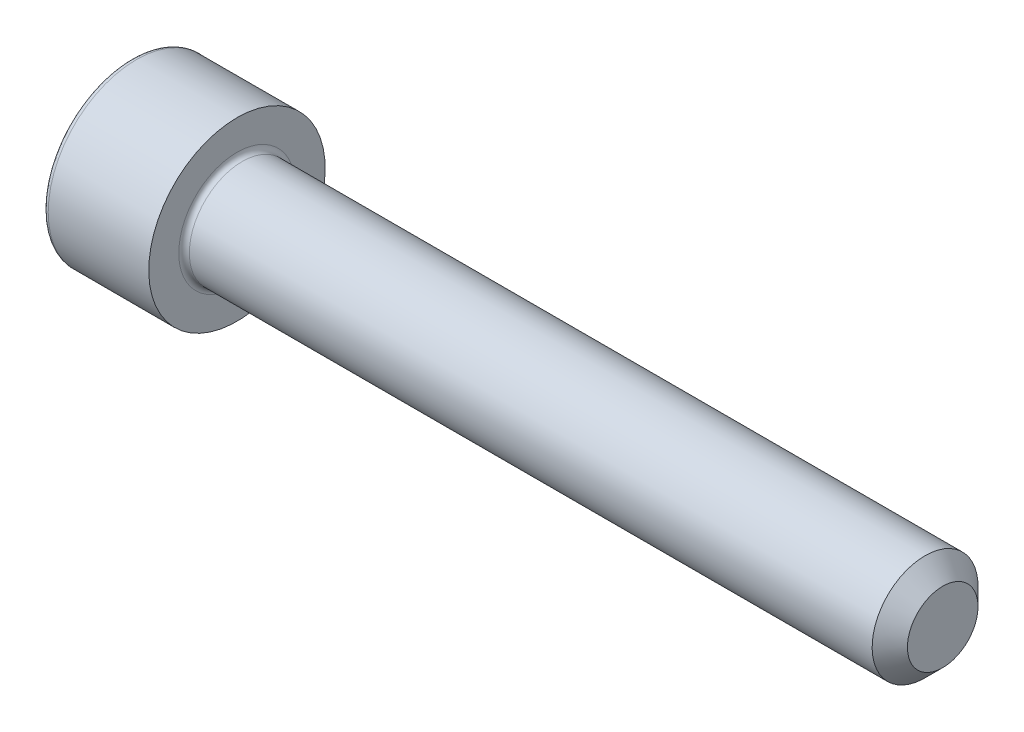
ISO-10303-21;
HEADER;
FILE_DESCRIPTION(('STEP AP214'),'2;1');
FILE_NAME('part.step','',(''),(''),'','','');
FILE_SCHEMA(('AUTOMOTIVE_DESIGN { 1 0 10303 214 1 1 1 1 }'));
ENDSEC;
DATA;
#1=APPLICATION_CONTEXT('core data for automotive mechanical design processes');
#2=APPLICATION_PROTOCOL_DEFINITION('international standard','automotive_design',2000,#1);
#3=PRODUCT_CONTEXT('',#1,'mechanical');
#4=PRODUCT('Part','Part','',(#3));
#5=PRODUCT_RELATED_PRODUCT_CATEGORY('part','',(#4));
#6=PRODUCT_DEFINITION_FORMATION('','',#4);
#7=PRODUCT_DEFINITION_CONTEXT('part definition',#1,'design');
#8=PRODUCT_DEFINITION('design','',#6,#7);
#9=PRODUCT_DEFINITION_SHAPE('','',#8);
#10=(LENGTH_UNIT() NAMED_UNIT(*) SI_UNIT(.MILLI.,.METRE.));
#11=(NAMED_UNIT(*) PLANE_ANGLE_UNIT() SI_UNIT($,.RADIAN.));
#12=(NAMED_UNIT(*) SI_UNIT($,.STERADIAN.) SOLID_ANGLE_UNIT());
#13=UNCERTAINTY_MEASURE_WITH_UNIT(LENGTH_MEASURE(1.E-05),#10,'distance_accuracy_value','');
#14=(GEOMETRIC_REPRESENTATION_CONTEXT(3) GLOBAL_UNCERTAINTY_ASSIGNED_CONTEXT((#13)) GLOBAL_UNIT_ASSIGNED_CONTEXT((#10,
#11,#12)) REPRESENTATION_CONTEXT('',''));
#15=CARTESIAN_POINT('',(0.,0.,0.));
#16=DIRECTION('',(0.,0.,1.));
#17=DIRECTION('',(1.,0.,0.));
#18=AXIS2_PLACEMENT_3D('',#15,#16,#17);
#19=CARTESIAN_POINT('',(0.,0.,0.));
#20=DIRECTION('',(-1.,0.,0.));
#21=DIRECTION('',(0.,-1.,0.));
#22=AXIS2_PLACEMENT_3D('',#19,#20,#21);
#23=PLANE('',#22);
#24=CARTESIAN_POINT('',(0.,0.,0.));
#25=DIRECTION('',(-1.,0.,0.));
#26=DIRECTION('',(0.,-1.,0.));
#27=AXIS2_PLACEMENT_3D('',#24,#25,#26);
#28=CIRCLE('',#27,4.7);
#29=CARTESIAN_POINT('',(0.,-4.7,0.));
#30=VERTEX_POINT('',#29);
#31=EDGE_CURVE('E159',#30,#30,#28,.T.);
#32=ORIENTED_EDGE('',*,*,#31,.T.);
#33=EDGE_LOOP('',(#32));
#34=FACE_BOUND('',#33,.T.);
#35=DIRECTION('',(0.,0.,-1.));
#36=VECTOR('',#35,1.);
#37=CARTESIAN_POINT('',(0.,2.5,1.44337567297407));
#38=LINE('',#37,#36);
#39=CARTESIAN_POINT('',(0.,2.5,1.44337567297407));
#40=VERTEX_POINT('',#39);
#41=CARTESIAN_POINT('',(0.,2.5,-1.44337567297406));
#42=VERTEX_POINT('',#41);
#43=EDGE_CURVE('E55',#40,#42,#38,.T.);
#44=ORIENTED_EDGE('',*,*,#43,.F.);
#45=DIRECTION('',(0.,0.866025403784439,-0.5));
#46=VECTOR('',#45,1.);
#47=CARTESIAN_POINT('',(0.,0.,2.88675134594813));
#48=LINE('',#47,#46);
#49=CARTESIAN_POINT('',(0.,0.,2.88675134594813));
#50=VERTEX_POINT('',#49);
#51=EDGE_CURVE('E138',#50,#40,#48,.T.);
#52=ORIENTED_EDGE('',*,*,#51,.F.);
#53=DIRECTION('',(0.,0.866025403784439,0.5));
#54=VECTOR('',#53,1.);
#55=CARTESIAN_POINT('',(0.,-2.5,1.44337567297406));
#56=LINE('',#55,#54);
#57=CARTESIAN_POINT('',(0.,-2.5,1.44337567297406));
#58=VERTEX_POINT('',#57);
#59=EDGE_CURVE('E136',#58,#50,#56,.T.);
#60=ORIENTED_EDGE('',*,*,#59,.F.);
#61=DIRECTION('',(0.,0.,1.));
#62=VECTOR('',#61,1.);
#63=CARTESIAN_POINT('',(0.,-2.5,-1.44337567297407));
#64=LINE('',#63,#62);
#65=CARTESIAN_POINT('',(0.,-2.5,-1.44337567297407));
#66=VERTEX_POINT('',#65);
#67=EDGE_CURVE('E103',#66,#58,#64,.T.);
#68=ORIENTED_EDGE('',*,*,#67,.F.);
#69=DIRECTION('',(0.,-0.866025403784439,0.5));
#70=VECTOR('',#69,1.);
#71=CARTESIAN_POINT('',(0.,0.,-2.88675134594813));
#72=LINE('',#71,#70);
#73=CARTESIAN_POINT('',(0.,0.,-2.88675134594813));
#74=VERTEX_POINT('',#73);
#75=EDGE_CURVE('E132',#74,#66,#72,.T.);
#76=ORIENTED_EDGE('',*,*,#75,.F.);
#77=DIRECTION('',(0.,-0.866025403784439,-0.5));
#78=VECTOR('',#77,1.);
#79=CARTESIAN_POINT('',(0.,2.5,-1.44337567297406));
#80=LINE('',#79,#78);
#81=EDGE_CURVE('E129',#42,#74,#80,.T.);
#82=ORIENTED_EDGE('',*,*,#81,.F.);
#83=EDGE_LOOP('',(#44,#52,#60,#68,#76,#82));
#84=FACE_BOUND('',#83,.T.);
#85=ADVANCED_FACE('F39',(#34,#84),#23,.T.);
#86=CARTESIAN_POINT('',(46.,0.,0.));
#87=DIRECTION('',(1.,0.,0.));
#88=DIRECTION('',(0.,1.,0.));
#89=AXIS2_PLACEMENT_3D('',#86,#87,#88);
#90=CYLINDRICAL_SURFACE('',#89,5.);
#91=CARTESIAN_POINT('',(0.300000000000002,0.,0.));
#92=DIRECTION('',(-1.,0.,0.));
#93=DIRECTION('',(0.,-1.,0.));
#94=AXIS2_PLACEMENT_3D('',#91,#92,#93);
#95=CIRCLE('',#94,5.);
#96=CARTESIAN_POINT('',(0.300000000000002,-5.,0.));
#97=VERTEX_POINT('',#96);
#98=EDGE_CURVE('E156',#97,#97,#95,.F.);
#99=ORIENTED_EDGE('',*,*,#98,.T.);
#100=EDGE_LOOP('',(#99));
#101=FACE_BOUND('',#100,.T.);
#102=CARTESIAN_POINT('',(6.,0.,0.));
#103=DIRECTION('',(1.,0.,0.));
#104=DIRECTION('',(0.,1.,0.));
#105=AXIS2_PLACEMENT_3D('',#102,#103,#104);
#106=CIRCLE('',#105,5.);
#107=CARTESIAN_POINT('',(6.,5.,0.));
#108=VERTEX_POINT('',#107);
#109=EDGE_CURVE('E142',#108,#108,#106,.T.);
#110=ORIENTED_EDGE('',*,*,#109,.F.);
#111=EDGE_LOOP('',(#110));
#112=FACE_BOUND('',#111,.T.);
#113=ADVANCED_FACE('F176',(#101,#112),#90,.T.);
#114=CARTESIAN_POINT('',(6.,5.,0.));
#115=DIRECTION('',(1.,0.,0.));
#116=DIRECTION('',(0.,1.,0.));
#117=AXIS2_PLACEMENT_3D('',#114,#115,#116);
#118=PLANE('',#117);
#119=CARTESIAN_POINT('',(6.,0.,0.));
#120=DIRECTION('',(1.,0.,0.));
#121=DIRECTION('',(0.,1.,0.));
#122=AXIS2_PLACEMENT_3D('',#119,#120,#121);
#123=CIRCLE('',#122,3.29999999999999);
#124=CARTESIAN_POINT('',(6.,3.29999999999999,0.));
#125=VERTEX_POINT('',#124);
#126=EDGE_CURVE('E153',#125,#125,#123,.F.);
#127=ORIENTED_EDGE('',*,*,#126,.T.);
#128=EDGE_LOOP('',(#127));
#129=FACE_BOUND('',#128,.T.);
#130=ORIENTED_EDGE('',*,*,#109,.T.);
#131=EDGE_LOOP('',(#130));
#132=FACE_BOUND('',#131,.T.);
#133=ADVANCED_FACE('F182',(#129,#132),#118,.T.);
#134=CARTESIAN_POINT('',(46.,0.,0.));
#135=DIRECTION('',(1.,0.,0.));
#136=DIRECTION('',(0.,1.,0.));
#137=AXIS2_PLACEMENT_3D('',#134,#135,#136);
#138=CYLINDRICAL_SURFACE('',#137,2.99999999999999);
#139=CARTESIAN_POINT('',(45.,0.,0.));
#140=DIRECTION('',(1.,0.,0.));
#141=DIRECTION('',(0.,1.,0.));
#142=AXIS2_PLACEMENT_3D('',#139,#140,#141);
#143=CIRCLE('',#142,2.99999999999999);
#144=CARTESIAN_POINT('',(45.,3.,0.));
#145=VERTEX_POINT('',#144);
#146=EDGE_CURVE('E11',#145,#145,#143,.F.);
#147=ORIENTED_EDGE('',*,*,#146,.T.);
#148=EDGE_LOOP('',(#147));
#149=FACE_BOUND('',#148,.T.);
#150=CARTESIAN_POINT('',(6.3,0.,0.));
#151=DIRECTION('',(1.,0.,0.));
#152=DIRECTION('',(0.,1.,0.));
#153=AXIS2_PLACEMENT_3D('',#150,#151,#152);
#154=CIRCLE('',#153,2.99999999999999);
#155=CARTESIAN_POINT('',(6.3,2.99999999999999,0.));
#156=VERTEX_POINT('',#155);
#157=EDGE_CURVE('E150',#156,#156,#154,.T.);
#158=ORIENTED_EDGE('',*,*,#157,.T.);
#159=EDGE_LOOP('',(#158));
#160=FACE_BOUND('',#159,.T.);
#161=ADVANCED_FACE('F199',(#149,#160),#138,.T.);
#162=CARTESIAN_POINT('',(46.,3.,0.));
#163=DIRECTION('',(1.,0.,0.));
#164=DIRECTION('',(0.,1.,0.));
#165=AXIS2_PLACEMENT_3D('',#162,#163,#164);
#166=PLANE('',#165);
#167=CARTESIAN_POINT('',(46.,0.,0.));
#168=DIRECTION('',(1.,0.,0.));
#169=DIRECTION('',(0.,1.,0.));
#170=AXIS2_PLACEMENT_3D('',#167,#168,#169);
#171=CIRCLE('',#170,1.99999999999999);
#172=CARTESIAN_POINT('',(46.,1.99999999999999,0.));
#173=VERTEX_POINT('',#172);
#174=EDGE_CURVE('E48',#173,#173,#171,.T.);
#175=ORIENTED_EDGE('',*,*,#174,.T.);
#176=EDGE_LOOP('',(#175));
#177=FACE_BOUND('',#176,.T.);
#178=ADVANCED_FACE('F164',(#177),#166,.T.);
#179=CARTESIAN_POINT('',(2.5,2.5,1.44337567297407));
#180=DIRECTION('',(0.,1.,0.));
#181=DIRECTION('',(-1.,0.,0.));
#182=AXIS2_PLACEMENT_3D('',#179,#180,#181);
#183=PLANE('',#182);
#184=ORIENTED_EDGE('',*,*,#43,.T.);
#185=DIRECTION('',(-1.,0.,0.));
#186=VECTOR('',#185,1.);
#187=CARTESIAN_POINT('',(2.5,2.5,-1.44337567297406));
#188=LINE('',#187,#186);
#189=CARTESIAN_POINT('',(2.5,2.5,-1.44337567297406));
#190=VERTEX_POINT('',#189);
#191=EDGE_CURVE('E85',#190,#42,#188,.T.);
#192=ORIENTED_EDGE('',*,*,#191,.F.);
#193=DIRECTION('',(0.,0.,-1.));
#194=VECTOR('',#193,1.);
#195=CARTESIAN_POINT('',(2.5,2.5,1.44337567297407));
#196=LINE('',#195,#194);
#197=CARTESIAN_POINT('',(2.5,2.5,1.44337567297407));
#198=VERTEX_POINT('',#197);
#199=EDGE_CURVE('E140',#198,#190,#196,.T.);
#200=ORIENTED_EDGE('',*,*,#199,.F.);
#201=DIRECTION('',(-1.,0.,0.));
#202=VECTOR('',#201,1.);
#203=CARTESIAN_POINT('',(2.5,2.5,1.44337567297407));
#204=LINE('',#203,#202);
#205=EDGE_CURVE('E63',#198,#40,#204,.T.);
#206=ORIENTED_EDGE('',*,*,#205,.T.);
#207=EDGE_LOOP('',(#184,#192,#200,#206));
#208=FACE_BOUND('',#207,.T.);
#209=ADVANCED_FACE('F207',(#208),#183,.F.);
#210=CARTESIAN_POINT('',(2.5,0.,2.88675134594813));
#211=DIRECTION('',(0.,0.5,0.866025403784439));
#212=DIRECTION('',(0.,-0.866025403784439,0.5));
#213=AXIS2_PLACEMENT_3D('',#210,#211,#212);
#214=PLANE('',#213);
#215=ORIENTED_EDGE('',*,*,#51,.T.);
#216=ORIENTED_EDGE('',*,*,#205,.F.);
#217=DIRECTION('',(0.,0.866025403784439,-0.5));
#218=VECTOR('',#217,1.);
#219=CARTESIAN_POINT('',(2.5,0.,2.88675134594813));
#220=LINE('',#219,#218);
#221=CARTESIAN_POINT('',(2.5,0.,2.88675134594813));
#222=VERTEX_POINT('',#221);
#223=EDGE_CURVE('E115',#222,#198,#220,.T.);
#224=ORIENTED_EDGE('',*,*,#223,.F.);
#225=DIRECTION('',(-1.,0.,0.));
#226=VECTOR('',#225,1.);
#227=CARTESIAN_POINT('',(2.5,0.,2.88675134594813));
#228=LINE('',#227,#226);
#229=EDGE_CURVE('E107',#222,#50,#228,.T.);
#230=ORIENTED_EDGE('',*,*,#229,.T.);
#231=EDGE_LOOP('',(#215,#216,#224,#230));
#232=FACE_BOUND('',#231,.T.);
#233=ADVANCED_FACE('F213',(#232),#214,.F.);
#234=CARTESIAN_POINT('',(2.5,-2.5,1.44337567297406));
#235=DIRECTION('',(0.,-0.5,0.866025403784439));
#236=DIRECTION('',(0.,-0.866025403784439,-0.5));
#237=AXIS2_PLACEMENT_3D('',#234,#235,#236);
#238=PLANE('',#237);
#239=ORIENTED_EDGE('',*,*,#59,.T.);
#240=ORIENTED_EDGE('',*,*,#229,.F.);
#241=DIRECTION('',(0.,0.866025403784439,0.5));
#242=VECTOR('',#241,1.);
#243=CARTESIAN_POINT('',(2.5,-2.5,1.44337567297406));
#244=LINE('',#243,#242);
#245=CARTESIAN_POINT('',(2.5,-2.5,1.44337567297406));
#246=VERTEX_POINT('',#245);
#247=EDGE_CURVE('E111',#246,#222,#244,.T.);
#248=ORIENTED_EDGE('',*,*,#247,.F.);
#249=DIRECTION('',(-1.,0.,0.));
#250=VECTOR('',#249,1.);
#251=CARTESIAN_POINT('',(2.5,-2.5,1.44337567297406));
#252=LINE('',#251,#250);
#253=EDGE_CURVE('E96',#246,#58,#252,.T.);
#254=ORIENTED_EDGE('',*,*,#253,.T.);
#255=EDGE_LOOP('',(#239,#240,#248,#254));
#256=FACE_BOUND('',#255,.T.);
#257=ADVANCED_FACE('F112',(#256),#238,.F.);
#258=CARTESIAN_POINT('',(2.5,-2.5,-1.44337567297407));
#259=DIRECTION('',(0.,-1.,0.));
#260=DIRECTION('',(1.,0.,0.));
#261=AXIS2_PLACEMENT_3D('',#258,#259,#260);
#262=PLANE('',#261);
#263=ORIENTED_EDGE('',*,*,#67,.T.);
#264=ORIENTED_EDGE('',*,*,#253,.F.);
#265=DIRECTION('',(0.,0.,1.));
#266=VECTOR('',#265,1.);
#267=CARTESIAN_POINT('',(2.5,-2.5,-1.44337567297407));
#268=LINE('',#267,#266);
#269=CARTESIAN_POINT('',(2.5,-2.5,-1.44337567297407));
#270=VERTEX_POINT('',#269);
#271=EDGE_CURVE('E100',#270,#246,#268,.T.);
#272=ORIENTED_EDGE('',*,*,#271,.F.);
#273=DIRECTION('',(-1.,0.,0.));
#274=VECTOR('',#273,1.);
#275=CARTESIAN_POINT('',(2.5,-2.5,-1.44337567297407));
#276=LINE('',#275,#274);
#277=EDGE_CURVE('E108',#270,#66,#276,.T.);
#278=ORIENTED_EDGE('',*,*,#277,.T.);
#279=EDGE_LOOP('',(#263,#264,#272,#278));
#280=FACE_BOUND('',#279,.T.);
#281=ADVANCED_FACE('F98',(#280),#262,.F.);
#282=CARTESIAN_POINT('',(2.5,0.,-2.88675134594813));
#283=DIRECTION('',(0.,-0.5,-0.866025403784439));
#284=DIRECTION('',(0.,0.866025403784439,-0.5));
#285=AXIS2_PLACEMENT_3D('',#282,#283,#284);
#286=PLANE('',#285);
#287=ORIENTED_EDGE('',*,*,#75,.T.);
#288=ORIENTED_EDGE('',*,*,#277,.F.);
#289=DIRECTION('',(0.,-0.866025403784439,0.5));
#290=VECTOR('',#289,1.);
#291=CARTESIAN_POINT('',(2.5,0.,-2.88675134594813));
#292=LINE('',#291,#290);
#293=CARTESIAN_POINT('',(2.5,0.,-2.88675134594813));
#294=VERTEX_POINT('',#293);
#295=EDGE_CURVE('E121',#294,#270,#292,.T.);
#296=ORIENTED_EDGE('',*,*,#295,.F.);
#297=DIRECTION('',(-1.,0.,0.));
#298=VECTOR('',#297,1.);
#299=CARTESIAN_POINT('',(2.5,0.,-2.88675134594813));
#300=LINE('',#299,#298);
#301=EDGE_CURVE('E145',#294,#74,#300,.T.);
#302=ORIENTED_EDGE('',*,*,#301,.T.);
#303=EDGE_LOOP('',(#287,#288,#296,#302));
#304=FACE_BOUND('',#303,.T.);
#305=ADVANCED_FACE('F216',(#304),#286,.F.);
#306=CARTESIAN_POINT('',(2.5,2.5,-1.44337567297406));
#307=DIRECTION('',(0.,0.5,-0.866025403784439));
#308=DIRECTION('',(0.,0.866025403784439,0.5));
#309=AXIS2_PLACEMENT_3D('',#306,#307,#308);
#310=PLANE('',#309);
#311=ORIENTED_EDGE('',*,*,#81,.T.);
#312=ORIENTED_EDGE('',*,*,#301,.F.);
#313=DIRECTION('',(0.,-0.866025403784439,-0.5));
#314=VECTOR('',#313,1.);
#315=CARTESIAN_POINT('',(2.5,2.5,-1.44337567297406));
#316=LINE('',#315,#314);
#317=EDGE_CURVE('E123',#190,#294,#316,.T.);
#318=ORIENTED_EDGE('',*,*,#317,.F.);
#319=ORIENTED_EDGE('',*,*,#191,.T.);
#320=EDGE_LOOP('',(#311,#312,#318,#319));
#321=FACE_BOUND('',#320,.T.);
#322=ADVANCED_FACE('F193',(#321),#310,.F.);
#323=CARTESIAN_POINT('',(2.5,0.,0.));
#324=DIRECTION('',(-1.,0.,0.));
#325=DIRECTION('',(0.,-1.,0.));
#326=AXIS2_PLACEMENT_3D('',#323,#324,#325);
#327=PLANE('',#326);
#328=ORIENTED_EDGE('',*,*,#199,.T.);
#329=ORIENTED_EDGE('',*,*,#317,.T.);
#330=ORIENTED_EDGE('',*,*,#295,.T.);
#331=ORIENTED_EDGE('',*,*,#271,.T.);
#332=ORIENTED_EDGE('',*,*,#247,.T.);
#333=ORIENTED_EDGE('',*,*,#223,.T.);
#334=EDGE_LOOP('',(#328,#329,#330,#331,#332,#333));
#335=FACE_BOUND('',#334,.T.);
#336=ADVANCED_FACE('F118',(#335),#327,.T.);
#337=CARTESIAN_POINT('',(6.3,0.,0.));
#338=DIRECTION('',(1.,0.,0.));
#339=DIRECTION('',(0.,1.,0.));
#340=AXIS2_PLACEMENT_3D('',#337,#338,#339);
#341=TOROIDAL_SURFACE('',#340,3.29999999999999,0.3);
#342=ORIENTED_EDGE('',*,*,#126,.F.);
#343=EDGE_LOOP('',(#342));
#344=FACE_BOUND('',#343,.T.);
#345=ORIENTED_EDGE('',*,*,#157,.F.);
#346=EDGE_LOOP('',(#345));
#347=FACE_BOUND('',#346,.T.);
#348=ADVANCED_FACE('F172',(#344,#347),#341,.F.);
#349=CARTESIAN_POINT('',(0.300000000000002,0.,0.));
#350=DIRECTION('',(-1.,0.,0.));
#351=DIRECTION('',(0.,-1.,0.));
#352=AXIS2_PLACEMENT_3D('',#349,#350,#351);
#353=TOROIDAL_SURFACE('',#352,4.7,0.3);
#354=ORIENTED_EDGE('',*,*,#31,.F.);
#355=EDGE_LOOP('',(#354));
#356=FACE_BOUND('',#355,.T.);
#357=ORIENTED_EDGE('',*,*,#98,.F.);
#358=EDGE_LOOP('',(#357));
#359=FACE_BOUND('',#358,.T.);
#360=ADVANCED_FACE('F167',(#356,#359),#353,.T.);
#361=CARTESIAN_POINT('',(46.,0.,0.));
#362=DIRECTION('',(-1.,0.,0.));
#363=DIRECTION('',(0.,-1.,0.));
#364=AXIS2_PLACEMENT_3D('',#361,#362,#363);
#365=CONICAL_SURFACE('',#364,1.99999999999999,0.785398163397447);
#366=ORIENTED_EDGE('',*,*,#146,.F.);
#367=EDGE_LOOP('',(#366));
#368=FACE_BOUND('',#367,.T.);
#369=ORIENTED_EDGE('',*,*,#174,.F.);
#370=EDGE_LOOP('',(#369));
#371=FACE_BOUND('',#370,.T.);
#372=ADVANCED_FACE('F42',(#368,#371),#365,.T.);
#373=CLOSED_SHELL('',(#85,#113,#133,#161,#178,#209,#233,#257,#281,#305,#322,#336,#348,#360,#372));
#374=MANIFOLD_SOLID_BREP('B2',#373);
#375=ADVANCED_BREP_SHAPE_REPRESENTATION('',(#18,#374),#14);
#376=SHAPE_DEFINITION_REPRESENTATION(#9,#375);
ENDSEC;
END-ISO-10303-21;
